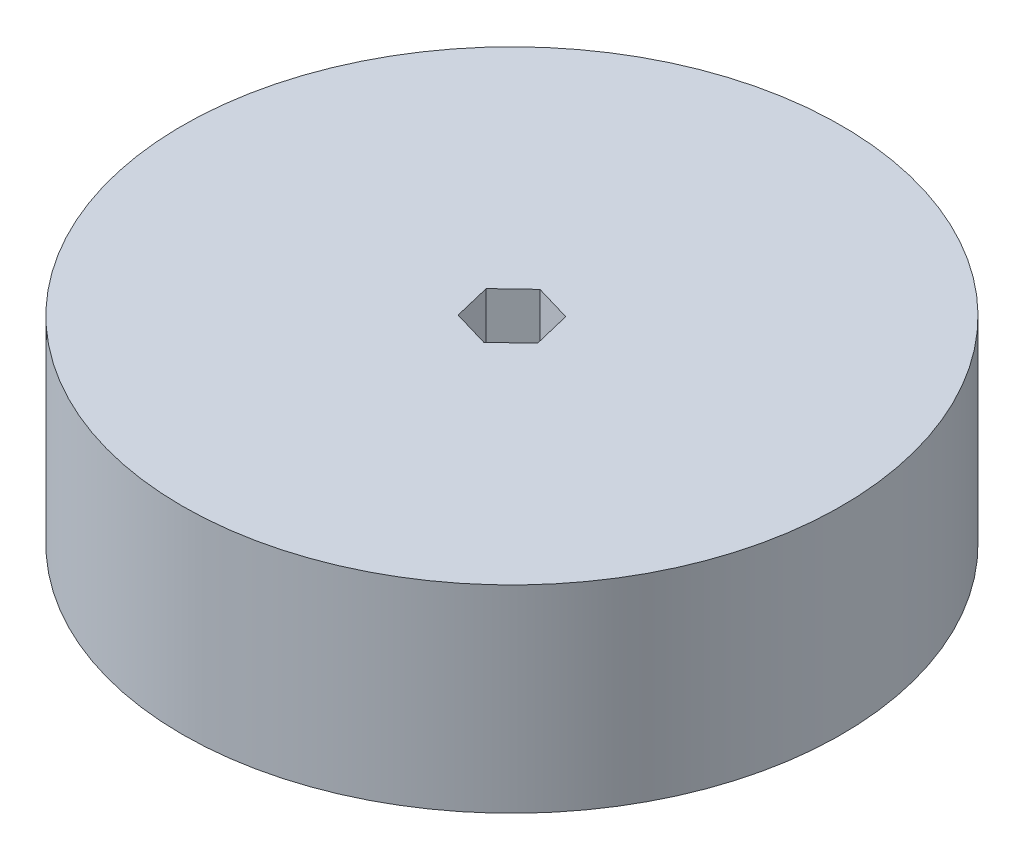
ISO-10303-21;
HEADER;
FILE_DESCRIPTION(('STEP AP214'),'2;1');
FILE_NAME('part.step','',(''),(''),'','','');
FILE_SCHEMA(('AUTOMOTIVE_DESIGN { 1 0 10303 214 1 1 1 1 }'));
ENDSEC;
DATA;
#1=APPLICATION_CONTEXT('core data for automotive mechanical design processes');
#2=APPLICATION_PROTOCOL_DEFINITION('international standard','automotive_design',2000,#1);
#3=PRODUCT_CONTEXT('',#1,'mechanical');
#4=PRODUCT('Part','Part','',(#3));
#5=PRODUCT_RELATED_PRODUCT_CATEGORY('part','',(#4));
#6=PRODUCT_DEFINITION_FORMATION('','',#4);
#7=PRODUCT_DEFINITION_CONTEXT('part definition',#1,'design');
#8=PRODUCT_DEFINITION('design','',#6,#7);
#9=PRODUCT_DEFINITION_SHAPE('','',#8);
#10=(LENGTH_UNIT() NAMED_UNIT(*) SI_UNIT(.MILLI.,.METRE.));
#11=(NAMED_UNIT(*) PLANE_ANGLE_UNIT() SI_UNIT($,.RADIAN.));
#12=(NAMED_UNIT(*) SI_UNIT($,.STERADIAN.) SOLID_ANGLE_UNIT());
#13=UNCERTAINTY_MEASURE_WITH_UNIT(LENGTH_MEASURE(1.E-05),#10,'distance_accuracy_value','');
#14=(GEOMETRIC_REPRESENTATION_CONTEXT(3) GLOBAL_UNCERTAINTY_ASSIGNED_CONTEXT((#13)) GLOBAL_UNIT_ASSIGNED_CONTEXT((#10,
#11,#12)) REPRESENTATION_CONTEXT('',''));
#15=CARTESIAN_POINT('',(0.,0.,0.));
#16=DIRECTION('',(0.,0.,1.));
#17=DIRECTION('',(1.,0.,0.));
#18=AXIS2_PLACEMENT_3D('',#15,#16,#17);
#19=CARTESIAN_POINT('',(0.,19.05,0.));
#20=DIRECTION('',(0.,1.,0.));
#21=DIRECTION('',(0.,0.,1.));
#22=AXIS2_PLACEMENT_3D('',#19,#20,#21);
#23=PLANE('',#22);
#24=CARTESIAN_POINT('',(0.,19.05,0.));
#25=DIRECTION('',(0.,1.,0.));
#26=DIRECTION('',(0.,0.,1.));
#27=AXIS2_PLACEMENT_3D('',#24,#25,#26);
#28=CIRCLE('',#27,63.5);
#29=CARTESIAN_POINT('',(0.,19.05,63.5));
#30=VERTEX_POINT('',#29);
#31=EDGE_CURVE('E11',#30,#30,#28,.T.);
#32=ORIENTED_EDGE('',*,*,#31,.T.);
#33=EDGE_LOOP('',(#32));
#34=FACE_BOUND('',#33,.T.);
#35=DIRECTION('',(0.234785573461979,0.,0.972047187380392));
#36=VECTOR('',#35,1.);
#37=CARTESIAN_POINT('',(-7.03326445402008,19.05,-2.07280593716577));
#38=LINE('',#37,#36);
#39=CARTESIAN_POINT('',(-7.03326445402008,19.05,-2.07280593716577));
#40=VERTEX_POINT('',#39);
#41=CARTESIAN_POINT('',(-5.31173482571063,19.05,5.05458272013264));
#42=VERTEX_POINT('',#41);
#43=EDGE_CURVE('E101',#40,#42,#38,.T.);
#44=ORIENTED_EDGE('',*,*,#43,.F.);
#45=DIRECTION('',(-0.724424771217642,0.,0.689353864750367));
#46=VECTOR('',#45,1.);
#47=CARTESIAN_POINT('',(-1.72152962830931,19.05,-7.12738865729854));
#48=LINE('',#47,#46);
#49=CARTESIAN_POINT('',(-1.72152962830931,19.05,-7.12738865729854));
#50=VERTEX_POINT('',#49);
#51=EDGE_CURVE('E93',#50,#40,#48,.T.);
#52=ORIENTED_EDGE('',*,*,#51,.F.);
#53=DIRECTION('',(-0.959210344679621,0.,-0.282693322630025));
#54=VECTOR('',#53,1.);
#55=CARTESIAN_POINT('',(5.31173482571089,19.05,-5.0545827201329));
#56=LINE('',#55,#54);
#57=CARTESIAN_POINT('',(5.31173482571089,19.05,-5.0545827201329));
#58=VERTEX_POINT('',#57);
#59=EDGE_CURVE('E121',#58,#50,#56,.T.);
#60=ORIENTED_EDGE('',*,*,#59,.F.);
#61=DIRECTION('',(-0.234785573461979,0.,-0.972047187380391));
#62=VECTOR('',#61,1.);
#63=CARTESIAN_POINT('',(7.03326445402034,19.05,2.07280593716552));
#64=LINE('',#63,#62);
#65=CARTESIAN_POINT('',(7.03326445402034,19.05,2.07280593716552));
#66=VERTEX_POINT('',#65);
#67=EDGE_CURVE('E119',#66,#58,#64,.T.);
#68=ORIENTED_EDGE('',*,*,#67,.F.);
#69=DIRECTION('',(0.724424771217642,0.,-0.689353864750367));
#70=VECTOR('',#69,1.);
#71=CARTESIAN_POINT('',(1.72152962830958,19.05,7.12738865729829));
#72=LINE('',#71,#70);
#73=CARTESIAN_POINT('',(1.72152962830958,19.05,7.12738865729829));
#74=VERTEX_POINT('',#73);
#75=EDGE_CURVE('E115',#74,#66,#72,.T.);
#76=ORIENTED_EDGE('',*,*,#75,.F.);
#77=DIRECTION('',(0.959210344679621,0.,0.282693322630025));
#78=VECTOR('',#77,1.);
#79=CARTESIAN_POINT('',(-5.31173482571063,19.05,5.05458272013264));
#80=LINE('',#79,#78);
#81=EDGE_CURVE('E113',#42,#74,#80,.T.);
#82=ORIENTED_EDGE('',*,*,#81,.F.);
#83=EDGE_LOOP('',(#44,#52,#60,#68,#76,#82));
#84=FACE_BOUND('',#83,.T.);
#85=ADVANCED_FACE('F39',(#34,#84),#23,.T.);
#86=CARTESIAN_POINT('',(0.,-19.05,0.));
#87=DIRECTION('',(0.,1.,0.));
#88=DIRECTION('',(0.,0.,1.));
#89=AXIS2_PLACEMENT_3D('',#86,#87,#88);
#90=PLANE('',#89);
#91=CARTESIAN_POINT('',(0.,-19.05,0.));
#92=DIRECTION('',(0.,1.,0.));
#93=DIRECTION('',(0.,0.,1.));
#94=AXIS2_PLACEMENT_3D('',#91,#92,#93);
#95=CIRCLE('',#94,63.5);
#96=CARTESIAN_POINT('',(0.,-19.05,63.5));
#97=VERTEX_POINT('',#96);
#98=EDGE_CURVE('E43',#97,#97,#95,.T.);
#99=ORIENTED_EDGE('',*,*,#98,.F.);
#100=EDGE_LOOP('',(#99));
#101=FACE_BOUND('',#100,.T.);
#102=DIRECTION('',(-0.724424771217642,0.,0.689353864750367));
#103=VECTOR('',#102,1.);
#104=CARTESIAN_POINT('',(-1.72152962830931,-19.05,-7.12738865729854));
#105=LINE('',#104,#103);
#106=CARTESIAN_POINT('',(-1.72152962830931,-19.05,-7.12738865729854));
#107=VERTEX_POINT('',#106);
#108=CARTESIAN_POINT('',(-7.03326445402008,-19.05,-2.07280593716577));
#109=VERTEX_POINT('',#108);
#110=EDGE_CURVE('E63',#107,#109,#105,.T.);
#111=ORIENTED_EDGE('',*,*,#110,.T.);
#112=DIRECTION('',(0.234785573461979,0.,0.972047187380392));
#113=VECTOR('',#112,1.);
#114=CARTESIAN_POINT('',(-7.03326445402008,-19.05,-2.07280593716577));
#115=LINE('',#114,#113);
#116=CARTESIAN_POINT('',(-5.31173482571063,-19.05,5.05458272013264));
#117=VERTEX_POINT('',#116);
#118=EDGE_CURVE('E108',#109,#117,#115,.T.);
#119=ORIENTED_EDGE('',*,*,#118,.T.);
#120=DIRECTION('',(0.959210344679621,0.,0.282693322630025));
#121=VECTOR('',#120,1.);
#122=CARTESIAN_POINT('',(-5.31173482571063,-19.05,5.05458272013264));
#123=LINE('',#122,#121);
#124=CARTESIAN_POINT('',(1.72152962830958,-19.05,7.12738865729829));
#125=VERTEX_POINT('',#124);
#126=EDGE_CURVE('E125',#117,#125,#123,.T.);
#127=ORIENTED_EDGE('',*,*,#126,.T.);
#128=DIRECTION('',(0.724424771217642,0.,-0.689353864750367));
#129=VECTOR('',#128,1.);
#130=CARTESIAN_POINT('',(1.72152962830958,-19.05,7.12738865729829));
#131=LINE('',#130,#129);
#132=CARTESIAN_POINT('',(7.03326445402034,-19.05,2.07280593716552));
#133=VERTEX_POINT('',#132);
#134=EDGE_CURVE('E128',#125,#133,#131,.T.);
#135=ORIENTED_EDGE('',*,*,#134,.T.);
#136=DIRECTION('',(-0.234785573461979,0.,-0.972047187380391));
#137=VECTOR('',#136,1.);
#138=CARTESIAN_POINT('',(7.03326445402034,-19.05,2.07280593716552));
#139=LINE('',#138,#137);
#140=CARTESIAN_POINT('',(5.31173482571089,-19.05,-5.0545827201329));
#141=VERTEX_POINT('',#140);
#142=EDGE_CURVE('E131',#133,#141,#139,.T.);
#143=ORIENTED_EDGE('',*,*,#142,.T.);
#144=DIRECTION('',(-0.959210344679621,0.,-0.282693322630025));
#145=VECTOR('',#144,1.);
#146=CARTESIAN_POINT('',(5.31173482571089,-19.05,-5.0545827201329));
#147=LINE('',#146,#145);
#148=EDGE_CURVE('E102',#141,#107,#147,.T.);
#149=ORIENTED_EDGE('',*,*,#148,.T.);
#150=EDGE_LOOP('',(#111,#119,#127,#135,#143,#149));
#151=FACE_BOUND('',#150,.T.);
#152=ADVANCED_FACE('F148',(#101,#151),#90,.F.);
#153=CARTESIAN_POINT('',(0.,19.05,0.));
#154=DIRECTION('',(0.,-1.,0.));
#155=DIRECTION('',(0.,0.,-1.));
#156=AXIS2_PLACEMENT_3D('',#153,#154,#155);
#157=CYLINDRICAL_SURFACE('',#156,63.5);
#158=ORIENTED_EDGE('',*,*,#31,.F.);
#159=EDGE_LOOP('',(#158));
#160=FACE_BOUND('',#159,.T.);
#161=ORIENTED_EDGE('',*,*,#98,.T.);
#162=EDGE_LOOP('',(#161));
#163=FACE_BOUND('',#162,.T.);
#164=ADVANCED_FACE('F41',(#160,#163),#157,.T.);
#165=CARTESIAN_POINT('',(-1.72152962830931,19.05,-7.12738865729854));
#166=DIRECTION('',(0.689353864750367,0.,0.724424771217642));
#167=DIRECTION('',(0.724424771217642,0.,-0.689353864750367));
#168=AXIS2_PLACEMENT_3D('',#165,#166,#167);
#169=PLANE('',#168);
#170=ORIENTED_EDGE('',*,*,#110,.F.);
#171=DIRECTION('',(0.,-1.,0.));
#172=VECTOR('',#171,1.);
#173=CARTESIAN_POINT('',(-1.72152962830931,19.05,-7.12738865729854));
#174=LINE('',#173,#172);
#175=EDGE_CURVE('E97',#50,#107,#174,.T.);
#176=ORIENTED_EDGE('',*,*,#175,.F.);
#177=ORIENTED_EDGE('',*,*,#51,.T.);
#178=DIRECTION('',(0.,-1.,0.));
#179=VECTOR('',#178,1.);
#180=CARTESIAN_POINT('',(-7.03326445402008,19.05,-2.07280593716577));
#181=LINE('',#180,#179);
#182=EDGE_CURVE('E96',#40,#109,#181,.T.);
#183=ORIENTED_EDGE('',*,*,#182,.T.);
#184=EDGE_LOOP('',(#170,#176,#177,#183));
#185=FACE_BOUND('',#184,.T.);
#186=ADVANCED_FACE('F95',(#185),#169,.T.);
#187=CARTESIAN_POINT('',(-7.03326445402008,19.05,-2.07280593716577));
#188=DIRECTION('',(0.972047187380391,0.,-0.234785573461978));
#189=DIRECTION('',(-0.234785573461979,0.,-0.972047187380392));
#190=AXIS2_PLACEMENT_3D('',#187,#188,#189);
#191=PLANE('',#190);
#192=ORIENTED_EDGE('',*,*,#118,.F.);
#193=ORIENTED_EDGE('',*,*,#182,.F.);
#194=ORIENTED_EDGE('',*,*,#43,.T.);
#195=DIRECTION('',(0.,-1.,0.));
#196=VECTOR('',#195,1.);
#197=CARTESIAN_POINT('',(-5.31173482571063,19.05,5.05458272013264));
#198=LINE('',#197,#196);
#199=EDGE_CURVE('E109',#42,#117,#198,.T.);
#200=ORIENTED_EDGE('',*,*,#199,.T.);
#201=EDGE_LOOP('',(#192,#193,#194,#200));
#202=FACE_BOUND('',#201,.T.);
#203=ADVANCED_FACE('F105',(#202),#191,.T.);
#204=CARTESIAN_POINT('',(-5.31173482571063,19.05,5.05458272013264));
#205=DIRECTION('',(0.282693322630025,0.,-0.959210344679621));
#206=DIRECTION('',(-0.959210344679621,0.,-0.282693322630025));
#207=AXIS2_PLACEMENT_3D('',#204,#205,#206);
#208=PLANE('',#207);
#209=ORIENTED_EDGE('',*,*,#126,.F.);
#210=ORIENTED_EDGE('',*,*,#199,.F.);
#211=ORIENTED_EDGE('',*,*,#81,.T.);
#212=DIRECTION('',(0.,-1.,0.));
#213=VECTOR('',#212,1.);
#214=CARTESIAN_POINT('',(1.72152962830958,19.05,7.12738865729829));
#215=LINE('',#214,#213);
#216=EDGE_CURVE('E140',#74,#125,#215,.T.);
#217=ORIENTED_EDGE('',*,*,#216,.T.);
#218=EDGE_LOOP('',(#209,#210,#211,#217));
#219=FACE_BOUND('',#218,.T.);
#220=ADVANCED_FACE('F144',(#219),#208,.T.);
#221=CARTESIAN_POINT('',(1.72152962830958,19.05,7.12738865729829));
#222=DIRECTION('',(-0.689353864750367,0.,-0.724424771217642));
#223=DIRECTION('',(-0.724424771217642,0.,0.689353864750367));
#224=AXIS2_PLACEMENT_3D('',#221,#222,#223);
#225=PLANE('',#224);
#226=ORIENTED_EDGE('',*,*,#134,.F.);
#227=ORIENTED_EDGE('',*,*,#216,.F.);
#228=ORIENTED_EDGE('',*,*,#75,.T.);
#229=DIRECTION('',(0.,-1.,0.));
#230=VECTOR('',#229,1.);
#231=CARTESIAN_POINT('',(7.03326445402034,19.05,2.07280593716552));
#232=LINE('',#231,#230);
#233=EDGE_CURVE('E138',#66,#133,#232,.T.);
#234=ORIENTED_EDGE('',*,*,#233,.T.);
#235=EDGE_LOOP('',(#226,#227,#228,#234));
#236=FACE_BOUND('',#235,.T.);
#237=ADVANCED_FACE('F156',(#236),#225,.T.);
#238=CARTESIAN_POINT('',(7.03326445402034,19.05,2.07280593716552));
#239=DIRECTION('',(-0.972047187380391,0.,0.234785573461979));
#240=DIRECTION('',(0.234785573461979,0.,0.972047187380391));
#241=AXIS2_PLACEMENT_3D('',#238,#239,#240);
#242=PLANE('',#241);
#243=ORIENTED_EDGE('',*,*,#142,.F.);
#244=ORIENTED_EDGE('',*,*,#233,.F.);
#245=ORIENTED_EDGE('',*,*,#67,.T.);
#246=DIRECTION('',(0.,-1.,0.));
#247=VECTOR('',#246,1.);
#248=CARTESIAN_POINT('',(5.31173482571089,19.05,-5.0545827201329));
#249=LINE('',#248,#247);
#250=EDGE_CURVE('E55',#58,#141,#249,.T.);
#251=ORIENTED_EDGE('',*,*,#250,.T.);
#252=EDGE_LOOP('',(#243,#244,#245,#251));
#253=FACE_BOUND('',#252,.T.);
#254=ADVANCED_FACE('F154',(#253),#242,.T.);
#255=CARTESIAN_POINT('',(5.31173482571089,19.05,-5.0545827201329));
#256=DIRECTION('',(-0.282693322630025,0.,0.959210344679621));
#257=DIRECTION('',(0.959210344679621,0.,0.282693322630025));
#258=AXIS2_PLACEMENT_3D('',#255,#256,#257);
#259=PLANE('',#258);
#260=ORIENTED_EDGE('',*,*,#148,.F.);
#261=ORIENTED_EDGE('',*,*,#250,.F.);
#262=ORIENTED_EDGE('',*,*,#59,.T.);
#263=ORIENTED_EDGE('',*,*,#175,.T.);
#264=EDGE_LOOP('',(#260,#261,#262,#263));
#265=FACE_BOUND('',#264,.T.);
#266=ADVANCED_FACE('F150',(#265),#259,.T.);
#267=CLOSED_SHELL('',(#85,#152,#164,#186,#203,#220,#237,#254,#266));
#268=MANIFOLD_SOLID_BREP('B2',#267);
#269=ADVANCED_BREP_SHAPE_REPRESENTATION('',(#18,#268),#14);
#270=SHAPE_DEFINITION_REPRESENTATION(#9,#269);
ENDSEC;
END-ISO-10303-21;
